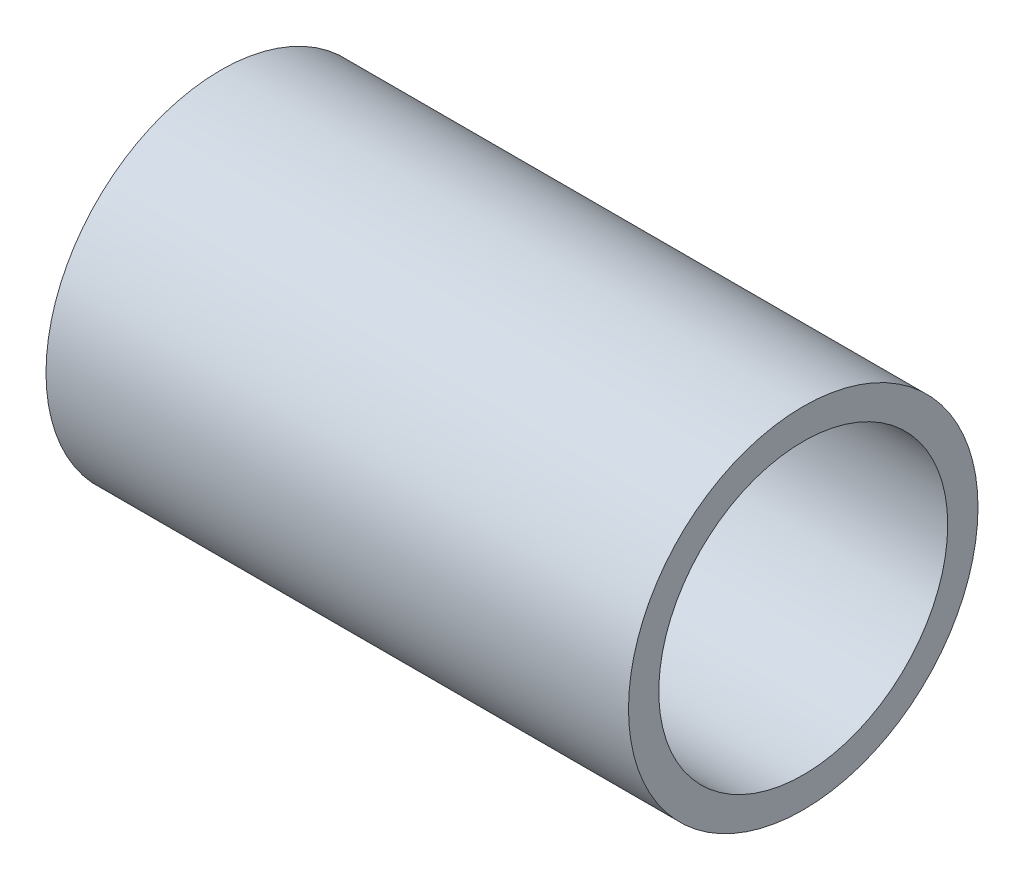
ISO-10303-21;
HEADER;
FILE_DESCRIPTION(('STEP AP214'),'2;1');
FILE_NAME('part.step','',(''),(''),'','','');
FILE_SCHEMA(('AUTOMOTIVE_DESIGN { 1 0 10303 214 1 1 1 1 }'));
ENDSEC;
DATA;
#1=APPLICATION_CONTEXT('core data for automotive mechanical design processes');
#2=APPLICATION_PROTOCOL_DEFINITION('international standard','automotive_design',2000,#1);
#3=PRODUCT_CONTEXT('',#1,'mechanical');
#4=PRODUCT('Part','Part','',(#3));
#5=PRODUCT_RELATED_PRODUCT_CATEGORY('part','',(#4));
#6=PRODUCT_DEFINITION_FORMATION('','',#4);
#7=PRODUCT_DEFINITION_CONTEXT('part definition',#1,'design');
#8=PRODUCT_DEFINITION('design','',#6,#7);
#9=PRODUCT_DEFINITION_SHAPE('','',#8);
#10=(LENGTH_UNIT() NAMED_UNIT(*) SI_UNIT(.MILLI.,.METRE.));
#11=(NAMED_UNIT(*) PLANE_ANGLE_UNIT() SI_UNIT($,.RADIAN.));
#12=(NAMED_UNIT(*) SI_UNIT($,.STERADIAN.) SOLID_ANGLE_UNIT());
#13=UNCERTAINTY_MEASURE_WITH_UNIT(LENGTH_MEASURE(1.E-05),#10,'distance_accuracy_value','');
#14=(GEOMETRIC_REPRESENTATION_CONTEXT(3) GLOBAL_UNCERTAINTY_ASSIGNED_CONTEXT((#13)) GLOBAL_UNIT_ASSIGNED_CONTEXT((#10,
#11,#12)) REPRESENTATION_CONTEXT('',''));
#15=CARTESIAN_POINT('',(0.,0.,0.));
#16=DIRECTION('',(0.,0.,1.));
#17=DIRECTION('',(1.,0.,0.));
#18=AXIS2_PLACEMENT_3D('',#15,#16,#17);
#19=CARTESIAN_POINT('',(15.875,0.,0.));
#20=DIRECTION('',(1.,0.,0.));
#21=DIRECTION('',(0.,0.,-1.));
#22=AXIS2_PLACEMENT_3D('',#19,#20,#21);
#23=PLANE('',#22);
#24=CARTESIAN_POINT('',(15.875,0.,0.));
#25=DIRECTION('',(1.,0.,0.));
#26=DIRECTION('',(0.,0.,-1.));
#27=AXIS2_PLACEMENT_3D('',#24,#25,#26);
#28=CIRCLE('',#27,9.525);
#29=CARTESIAN_POINT('',(15.875,0.,-9.525));
#30=VERTEX_POINT('',#29);
#31=EDGE_CURVE('E10',#30,#30,#28,.T.);
#32=ORIENTED_EDGE('',*,*,#31,.T.);
#33=EDGE_LOOP('',(#32));
#34=FACE_BOUND('',#33,.T.);
#35=CARTESIAN_POINT('',(15.875,0.,0.));
#36=DIRECTION('',(1.,0.,0.));
#37=DIRECTION('',(0.,0.,-1.));
#38=AXIS2_PLACEMENT_3D('',#35,#36,#37);
#39=CIRCLE('',#38,7.874);
#40=CARTESIAN_POINT('',(15.875,0.,-7.874));
#41=VERTEX_POINT('',#40);
#42=EDGE_CURVE('E42',#41,#41,#39,.T.);
#43=ORIENTED_EDGE('',*,*,#42,.F.);
#44=EDGE_LOOP('',(#43));
#45=FACE_BOUND('',#44,.T.);
#46=ADVANCED_FACE('F31',(#34,#45),#23,.T.);
#47=CARTESIAN_POINT('',(-15.875,0.,0.));
#48=DIRECTION('',(1.,0.,0.));
#49=DIRECTION('',(0.,0.,-1.));
#50=AXIS2_PLACEMENT_3D('',#47,#48,#49);
#51=PLANE('',#50);
#52=CARTESIAN_POINT('',(-15.875,0.,0.));
#53=DIRECTION('',(1.,0.,0.));
#54=DIRECTION('',(0.,0.,-1.));
#55=AXIS2_PLACEMENT_3D('',#52,#53,#54);
#56=CIRCLE('',#55,9.525);
#57=CARTESIAN_POINT('',(-15.875,0.,-9.525));
#58=VERTEX_POINT('',#57);
#59=EDGE_CURVE('E35',#58,#58,#56,.T.);
#60=ORIENTED_EDGE('',*,*,#59,.F.);
#61=EDGE_LOOP('',(#60));
#62=FACE_BOUND('',#61,.T.);
#63=CARTESIAN_POINT('',(-15.875,0.,0.));
#64=DIRECTION('',(1.,0.,0.));
#65=DIRECTION('',(0.,0.,-1.));
#66=AXIS2_PLACEMENT_3D('',#63,#64,#65);
#67=CIRCLE('',#66,7.874);
#68=CARTESIAN_POINT('',(-15.875,0.,-7.874));
#69=VERTEX_POINT('',#68);
#70=EDGE_CURVE('E44',#69,#69,#67,.T.);
#71=ORIENTED_EDGE('',*,*,#70,.T.);
#72=EDGE_LOOP('',(#71));
#73=FACE_BOUND('',#72,.T.);
#74=ADVANCED_FACE('F54',(#62,#73),#51,.F.);
#75=CARTESIAN_POINT('',(15.875,0.,0.));
#76=DIRECTION('',(-1.,0.,0.));
#77=DIRECTION('',(0.,0.,1.));
#78=AXIS2_PLACEMENT_3D('',#75,#76,#77);
#79=CYLINDRICAL_SURFACE('',#78,9.525);
#80=ORIENTED_EDGE('',*,*,#31,.F.);
#81=EDGE_LOOP('',(#80));
#82=FACE_BOUND('',#81,.T.);
#83=ORIENTED_EDGE('',*,*,#59,.T.);
#84=EDGE_LOOP('',(#83));
#85=FACE_BOUND('',#84,.T.);
#86=ADVANCED_FACE('F33',(#82,#85),#79,.T.);
#87=CARTESIAN_POINT('',(15.875,0.,0.));
#88=DIRECTION('',(-1.,0.,0.));
#89=DIRECTION('',(0.,0.,1.));
#90=AXIS2_PLACEMENT_3D('',#87,#88,#89);
#91=CYLINDRICAL_SURFACE('',#90,7.874);
#92=ORIENTED_EDGE('',*,*,#42,.T.);
#93=EDGE_LOOP('',(#92));
#94=FACE_BOUND('',#93,.T.);
#95=ORIENTED_EDGE('',*,*,#70,.F.);
#96=EDGE_LOOP('',(#95));
#97=FACE_BOUND('',#96,.T.);
#98=ADVANCED_FACE('F50',(#94,#97),#91,.F.);
#99=CLOSED_SHELL('',(#46,#74,#86,#98));
#100=MANIFOLD_SOLID_BREP('B2',#99);
#101=ADVANCED_BREP_SHAPE_REPRESENTATION('',(#18,#100),#14);
#102=SHAPE_DEFINITION_REPRESENTATION(#9,#101);
ENDSEC;
END-ISO-10303-21;
